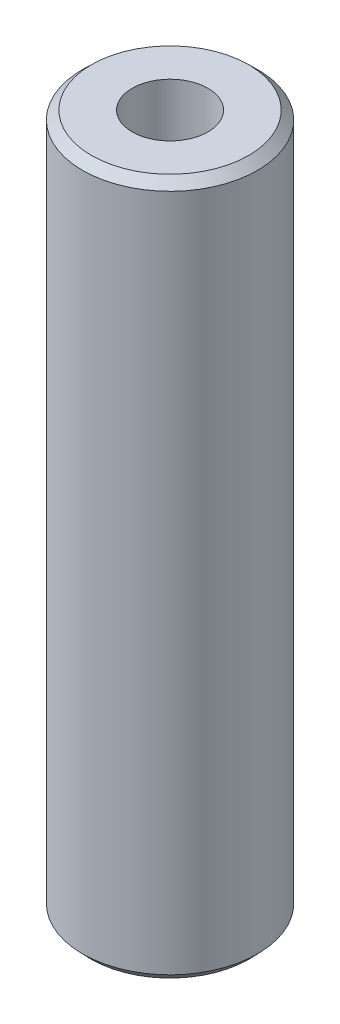
ISO-10303-21;
HEADER;
FILE_DESCRIPTION(('STEP AP214'),'2;1');
FILE_NAME('part.step','',(''),(''),'','','');
FILE_SCHEMA(('AUTOMOTIVE_DESIGN { 1 0 10303 214 1 1 1 1 }'));
ENDSEC;
DATA;
#1=APPLICATION_CONTEXT('core data for automotive mechanical design processes');
#2=APPLICATION_PROTOCOL_DEFINITION('international standard','automotive_design',2000,#1);
#3=PRODUCT_CONTEXT('',#1,'mechanical');
#4=PRODUCT('Part','Part','',(#3));
#5=PRODUCT_RELATED_PRODUCT_CATEGORY('part','',(#4));
#6=PRODUCT_DEFINITION_FORMATION('','',#4);
#7=PRODUCT_DEFINITION_CONTEXT('part definition',#1,'design');
#8=PRODUCT_DEFINITION('design','',#6,#7);
#9=PRODUCT_DEFINITION_SHAPE('','',#8);
#10=(LENGTH_UNIT() NAMED_UNIT(*) SI_UNIT(.MILLI.,.METRE.));
#11=(NAMED_UNIT(*) PLANE_ANGLE_UNIT() SI_UNIT($,.RADIAN.));
#12=(NAMED_UNIT(*) SI_UNIT($,.STERADIAN.) SOLID_ANGLE_UNIT());
#13=UNCERTAINTY_MEASURE_WITH_UNIT(LENGTH_MEASURE(1.E-05),#10,'distance_accuracy_value','');
#14=(GEOMETRIC_REPRESENTATION_CONTEXT(3) GLOBAL_UNCERTAINTY_ASSIGNED_CONTEXT((#13)) GLOBAL_UNIT_ASSIGNED_CONTEXT((#10,
#11,#12)) REPRESENTATION_CONTEXT('',''));
#15=CARTESIAN_POINT('',(0.,0.,0.));
#16=DIRECTION('',(0.,0.,1.));
#17=DIRECTION('',(1.,0.,0.));
#18=AXIS2_PLACEMENT_3D('',#15,#16,#17);
#19=CARTESIAN_POINT('',(0.,318.233432006182,0.));
#20=DIRECTION('',(0.,-1.,0.));
#21=DIRECTION('',(0.,0.,-1.));
#22=AXIS2_PLACEMENT_3D('',#19,#20,#21);
#23=CYLINDRICAL_SURFACE('',#22,40.);
#24=CARTESIAN_POINT('',(0.,314.33499567288,0.));
#25=DIRECTION('',(0.,1.,0.));
#26=DIRECTION('',(0.,0.,1.));
#27=AXIS2_PLACEMENT_3D('',#24,#25,#26);
#28=CIRCLE('',#27,40.);
#29=CARTESIAN_POINT('',(0.,314.33499567288,40.));
#30=VERTEX_POINT('',#29);
#31=EDGE_CURVE('E50',#30,#30,#28,.F.);
#32=ORIENTED_EDGE('',*,*,#31,.T.);
#33=EDGE_LOOP('',(#32));
#34=FACE_BOUND('',#33,.T.);
#35=CARTESIAN_POINT('',(0.,4.04612359024964,0.));
#36=DIRECTION('',(0.,1.,0.));
#37=DIRECTION('',(0.,0.,1.));
#38=AXIS2_PLACEMENT_3D('',#35,#36,#37);
#39=CIRCLE('',#38,40.);
#40=CARTESIAN_POINT('',(0.,4.04612359024964,40.));
#41=VERTEX_POINT('',#40);
#42=EDGE_CURVE('E51',#41,#41,#39,.T.);
#43=ORIENTED_EDGE('',*,*,#42,.T.);
#44=EDGE_LOOP('',(#43));
#45=FACE_BOUND('',#44,.T.);
#46=ADVANCED_FACE('F39',(#34,#45),#23,.T.);
#47=CARTESIAN_POINT('',(0.,318.233432006182,0.));
#48=DIRECTION('',(0.,1.,0.));
#49=DIRECTION('',(0.,0.,1.));
#50=AXIS2_PLACEMENT_3D('',#47,#48,#49);
#51=PLANE('',#50);
#52=CARTESIAN_POINT('',(0.,318.233432006182,0.));
#53=DIRECTION('',(0.,1.,0.));
#54=DIRECTION('',(0.,0.,1.));
#55=AXIS2_PLACEMENT_3D('',#52,#53,#54);
#56=CIRCLE('',#55,35.9538764097503);
#57=CARTESIAN_POINT('',(0.,318.233432006182,35.9538764097503));
#58=VERTEX_POINT('',#57);
#59=EDGE_CURVE('E54',#58,#58,#56,.T.);
#60=ORIENTED_EDGE('',*,*,#59,.T.);
#61=EDGE_LOOP('',(#60));
#62=FACE_BOUND('',#61,.T.);
#63=CARTESIAN_POINT('',(0.,318.233432006182,0.));
#64=DIRECTION('',(0.,1.,0.));
#65=DIRECTION('',(0.,0.,1.));
#66=AXIS2_PLACEMENT_3D('',#63,#64,#65);
#67=CIRCLE('',#66,17.3095673050024);
#68=CARTESIAN_POINT('',(0.,318.233432006182,17.3095673050024));
#69=VERTEX_POINT('',#68);
#70=EDGE_CURVE('E58',#69,#69,#67,.T.);
#71=ORIENTED_EDGE('',*,*,#70,.F.);
#72=EDGE_LOOP('',(#71));
#73=FACE_BOUND('',#72,.T.);
#74=ADVANCED_FACE('F69',(#62,#73),#51,.T.);
#75=CARTESIAN_POINT('',(0.,0.,0.));
#76=DIRECTION('',(0.,1.,0.));
#77=DIRECTION('',(0.,0.,1.));
#78=AXIS2_PLACEMENT_3D('',#75,#76,#77);
#79=PLANE('',#78);
#80=CARTESIAN_POINT('',(0.,0.,0.));
#81=DIRECTION('',(0.,1.,0.));
#82=DIRECTION('',(0.,0.,1.));
#83=AXIS2_PLACEMENT_3D('',#80,#81,#82);
#84=CIRCLE('',#83,36.1015636666983);
#85=CARTESIAN_POINT('',(0.,0.,36.1015636666983));
#86=VERTEX_POINT('',#85);
#87=EDGE_CURVE('E10',#86,#86,#84,.F.);
#88=ORIENTED_EDGE('',*,*,#87,.T.);
#89=EDGE_LOOP('',(#88));
#90=FACE_BOUND('',#89,.T.);
#91=CARTESIAN_POINT('',(0.,0.,0.));
#92=DIRECTION('',(0.,1.,0.));
#93=DIRECTION('',(0.,0.,1.));
#94=AXIS2_PLACEMENT_3D('',#91,#92,#93);
#95=CIRCLE('',#94,17.3095673050024);
#96=CARTESIAN_POINT('',(0.,0.,17.3095673050024));
#97=VERTEX_POINT('',#96);
#98=EDGE_CURVE('E63',#97,#97,#95,.T.);
#99=ORIENTED_EDGE('',*,*,#98,.T.);
#100=EDGE_LOOP('',(#99));
#101=FACE_BOUND('',#100,.T.);
#102=ADVANCED_FACE('F75',(#90,#101),#79,.F.);
#103=CARTESIAN_POINT('',(0.,318.233432006182,0.));
#104=DIRECTION('',(0.,-1.,0.));
#105=DIRECTION('',(0.,0.,-1.));
#106=AXIS2_PLACEMENT_3D('',#103,#104,#105);
#107=CYLINDRICAL_SURFACE('',#106,17.3095673050024);
#108=ORIENTED_EDGE('',*,*,#70,.T.);
#109=EDGE_LOOP('',(#108));
#110=FACE_BOUND('',#109,.T.);
#111=ORIENTED_EDGE('',*,*,#98,.F.);
#112=EDGE_LOOP('',(#111));
#113=FACE_BOUND('',#112,.T.);
#114=ADVANCED_FACE('F70',(#110,#113),#107,.F.);
#115=CARTESIAN_POINT('',(0.,318.233432006182,0.));
#116=DIRECTION('',(0.,-1.,0.));
#117=DIRECTION('',(0.,0.,-1.));
#118=AXIS2_PLACEMENT_3D('',#115,#116,#117);
#119=CONICAL_SURFACE('',#118,35.9538764097503,0.803985756592794);
#120=ORIENTED_EDGE('',*,*,#31,.F.);
#121=EDGE_LOOP('',(#120));
#122=FACE_BOUND('',#121,.T.);
#123=ORIENTED_EDGE('',*,*,#59,.F.);
#124=EDGE_LOOP('',(#123));
#125=FACE_BOUND('',#124,.T.);
#126=ADVANCED_FACE('F81',(#122,#125),#119,.T.);
#127=CARTESIAN_POINT('',(0.,4.04612359024964,0.));
#128=DIRECTION('',(0.,1.,0.));
#129=DIRECTION('',(0.,0.,1.));
#130=AXIS2_PLACEMENT_3D('',#127,#128,#129);
#131=CONICAL_SURFACE('',#130,40.,0.766810570202108);
#132=ORIENTED_EDGE('',*,*,#87,.F.);
#133=EDGE_LOOP('',(#132));
#134=FACE_BOUND('',#133,.T.);
#135=ORIENTED_EDGE('',*,*,#42,.F.);
#136=EDGE_LOOP('',(#135));
#137=FACE_BOUND('',#136,.T.);
#138=ADVANCED_FACE('F45',(#134,#137),#131,.T.);
#139=CLOSED_SHELL('',(#46,#74,#102,#114,#126,#138));
#140=MANIFOLD_SOLID_BREP('B2',#139);
#141=ADVANCED_BREP_SHAPE_REPRESENTATION('',(#18,#140),#14);
#142=SHAPE_DEFINITION_REPRESENTATION(#9,#141);
ENDSEC;
END-ISO-10303-21;
